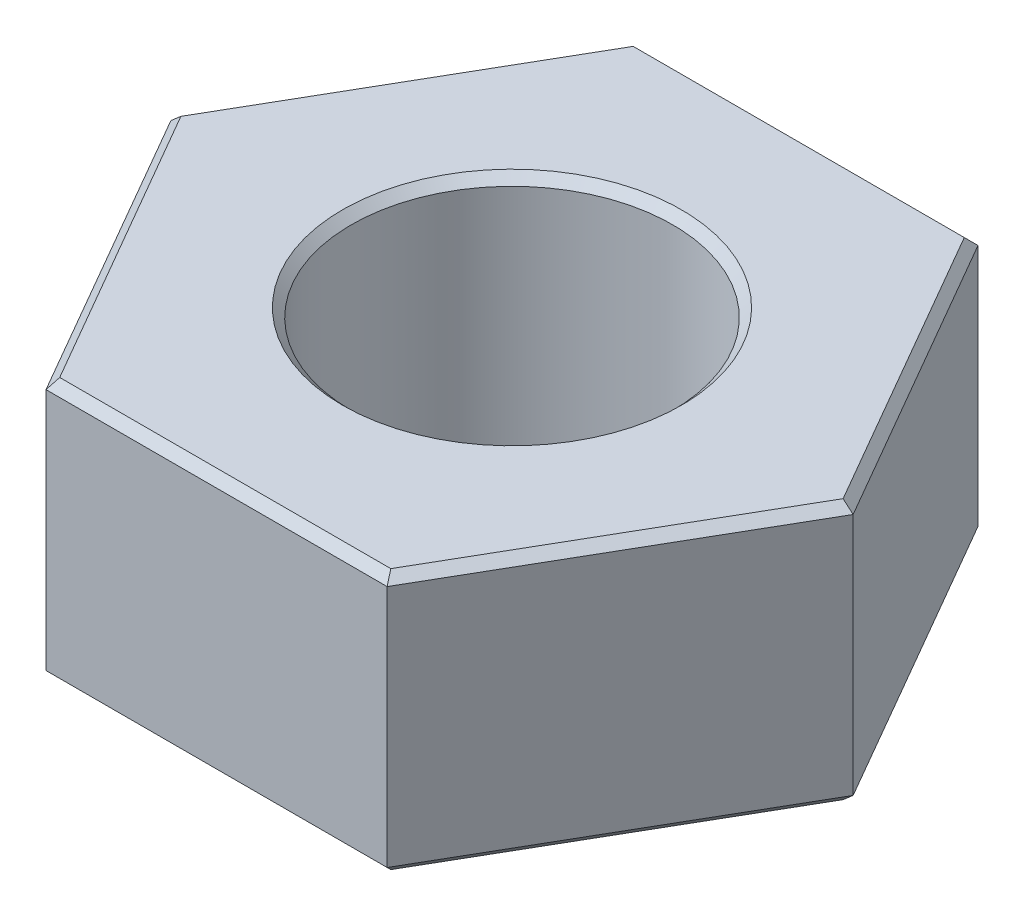
ISO-10303-21;
HEADER;
FILE_DESCRIPTION(('STEP AP214'),'2;1');
FILE_NAME('part.step','',(''),(''),'','','');
FILE_SCHEMA(('AUTOMOTIVE_DESIGN { 1 0 10303 214 1 1 1 1 }'));
ENDSEC;
DATA;
#1=APPLICATION_CONTEXT('core data for automotive mechanical design processes');
#2=APPLICATION_PROTOCOL_DEFINITION('international standard','automotive_design',2000,#1);
#3=PRODUCT_CONTEXT('',#1,'mechanical');
#4=PRODUCT('Part','Part','',(#3));
#5=PRODUCT_RELATED_PRODUCT_CATEGORY('part','',(#4));
#6=PRODUCT_DEFINITION_FORMATION('','',#4);
#7=PRODUCT_DEFINITION_CONTEXT('part definition',#1,'design');
#8=PRODUCT_DEFINITION('design','',#6,#7);
#9=PRODUCT_DEFINITION_SHAPE('','',#8);
#10=(LENGTH_UNIT() NAMED_UNIT(*) SI_UNIT(.MILLI.,.METRE.));
#11=(NAMED_UNIT(*) PLANE_ANGLE_UNIT() SI_UNIT($,.RADIAN.));
#12=(NAMED_UNIT(*) SI_UNIT($,.STERADIAN.) SOLID_ANGLE_UNIT());
#13=UNCERTAINTY_MEASURE_WITH_UNIT(LENGTH_MEASURE(1.E-05),#10,'distance_accuracy_value','');
#14=(GEOMETRIC_REPRESENTATION_CONTEXT(3) GLOBAL_UNCERTAINTY_ASSIGNED_CONTEXT((#13)) GLOBAL_UNIT_ASSIGNED_CONTEXT((#10,
#11,#12)) REPRESENTATION_CONTEXT('',''));
#15=CARTESIAN_POINT('',(0.,0.,0.));
#16=DIRECTION('',(0.,0.,1.));
#17=DIRECTION('',(1.,0.,0.));
#18=AXIS2_PLACEMENT_3D('',#15,#16,#17);
#19=CARTESIAN_POINT('',(0.,3.,0.));
#20=DIRECTION('',(0.,1.,0.));
#21=DIRECTION('',(0.,0.,1.));
#22=AXIS2_PLACEMENT_3D('',#19,#20,#21);
#23=PLANE('',#22);
#24=DIRECTION('',(-0.500000000000001,0.,-0.866025403784438));
#25=VECTOR('',#24,1.);
#26=CARTESIAN_POINT('',(1.87638837486628,3.,-3.35000000000001));
#27=LINE('',#26,#25);
#28=CARTESIAN_POINT('',(3.81051177665153,3.,0.));
#29=VERTEX_POINT('',#28);
#30=CARTESIAN_POINT('',(1.90525588832576,3.,-3.30000000000001));
#31=VERTEX_POINT('',#30);
#32=EDGE_CURVE('E59',#29,#31,#27,.T.);
#33=ORIENTED_EDGE('',*,*,#32,.T.);
#34=DIRECTION('',(-1.,0.,0.));
#35=VECTOR('',#34,1.);
#36=CARTESIAN_POINT('',(-1.96299091524474,3.,-3.29999999999999));
#37=LINE('',#36,#35);
#38=CARTESIAN_POINT('',(-1.90525588832578,3.,-3.29999999999999));
#39=VERTEX_POINT('',#38);
#40=EDGE_CURVE('E11',#31,#39,#37,.T.);
#41=ORIENTED_EDGE('',*,*,#40,.T.);
#42=DIRECTION('',(-0.499999999999995,0.,0.866025403784442));
#43=VECTOR('',#42,1.);
#44=CARTESIAN_POINT('',(-3.83937929011101,3.,0.0500000000000267));
#45=LINE('',#44,#43);
#46=CARTESIAN_POINT('',(-3.81051177665153,3.,0.));
#47=VERTEX_POINT('',#46);
#48=EDGE_CURVE('E44',#39,#47,#45,.T.);
#49=ORIENTED_EDGE('',*,*,#48,.T.);
#50=DIRECTION('',(0.500000000000007,0.,0.866025403784435));
#51=VECTOR('',#50,1.);
#52=CARTESIAN_POINT('',(-1.87638837486625,3.,3.35000000000002));
#53=LINE('',#52,#51);
#54=CARTESIAN_POINT('',(-1.90525588832574,3.,3.30000000000002));
#55=VERTEX_POINT('',#54);
#56=EDGE_CURVE('E262',#47,#55,#53,.T.);
#57=ORIENTED_EDGE('',*,*,#56,.T.);
#58=DIRECTION('',(1.,0.,0.));
#59=VECTOR('',#58,1.);
#60=CARTESIAN_POINT('',(1.96299091524477,3.,3.29999999999998));
#61=LINE('',#60,#59);
#62=CARTESIAN_POINT('',(1.90525588832581,3.,3.29999999999998));
#63=VERTEX_POINT('',#62);
#64=EDGE_CURVE('E260',#55,#63,#61,.T.);
#65=ORIENTED_EDGE('',*,*,#64,.T.);
#66=DIRECTION('',(0.499999999999995,0.,-0.866025403784442));
#67=VECTOR('',#66,1.);
#68=CARTESIAN_POINT('',(3.83937929011101,3.,-0.0499999999999993));
#69=LINE('',#68,#67);
#70=EDGE_CURVE('E264',#63,#29,#69,.T.);
#71=ORIENTED_EDGE('',*,*,#70,.T.);
#72=EDGE_LOOP('',(#33,#41,#49,#57,#65,#71));
#73=FACE_BOUND('',#72,.T.);
#74=CARTESIAN_POINT('',(0.,3.,0.));
#75=DIRECTION('',(0.,1.,0.));
#76=DIRECTION('',(0.,0.,1.));
#77=AXIS2_PLACEMENT_3D('',#74,#75,#76);
#78=CIRCLE('',#77,1.95);
#79=CARTESIAN_POINT('',(0.,3.,1.95));
#80=VERTEX_POINT('',#79);
#81=EDGE_CURVE('E257',#80,#80,#78,.F.);
#82=ORIENTED_EDGE('',*,*,#81,.T.);
#83=EDGE_LOOP('',(#82));
#84=FACE_BOUND('',#83,.T.);
#85=ADVANCED_FACE('F35',(#73,#84),#23,.T.);
#86=CARTESIAN_POINT('',(0.,0.,0.));
#87=DIRECTION('',(0.,1.,0.));
#88=DIRECTION('',(0.,0.,1.));
#89=AXIS2_PLACEMENT_3D('',#86,#87,#88);
#90=PLANE('',#89);
#91=DIRECTION('',(0.499999999999995,0.,-0.866025403784442));
#92=VECTOR('',#91,1.);
#93=CARTESIAN_POINT('',(-2.85788383248866,0.,-1.64999999999998));
#94=LINE('',#93,#92);
#95=CARTESIAN_POINT('',(-3.81051177665153,0.,0.));
#96=VERTEX_POINT('',#95);
#97=CARTESIAN_POINT('',(-1.90525588832578,0.,-3.29999999999999));
#98=VERTEX_POINT('',#97);
#99=EDGE_CURVE('E230',#96,#98,#94,.T.);
#100=ORIENTED_EDGE('',*,*,#99,.T.);
#101=DIRECTION('',(1.,0.,0.));
#102=VECTOR('',#101,1.);
#103=CARTESIAN_POINT('',(0.,0.,-3.3));
#104=LINE('',#103,#102);
#105=CARTESIAN_POINT('',(1.90525588832576,0.,-3.30000000000001));
#106=VERTEX_POINT('',#105);
#107=EDGE_CURVE('E139',#98,#106,#104,.T.);
#108=ORIENTED_EDGE('',*,*,#107,.T.);
#109=DIRECTION('',(0.500000000000001,0.,0.866025403784438));
#110=VECTOR('',#109,1.);
#111=CARTESIAN_POINT('',(2.85788383248865,0.,-1.65));
#112=LINE('',#111,#110);
#113=CARTESIAN_POINT('',(3.81051177665153,0.,0.));
#114=VERTEX_POINT('',#113);
#115=EDGE_CURVE('E222',#106,#114,#112,.T.);
#116=ORIENTED_EDGE('',*,*,#115,.T.);
#117=DIRECTION('',(-0.499999999999995,0.,0.866025403784442));
#118=VECTOR('',#117,1.);
#119=CARTESIAN_POINT('',(2.85788383248867,0.,1.64999999999999));
#120=LINE('',#119,#118);
#121=CARTESIAN_POINT('',(1.9052558883258,0.,3.29999999999998));
#122=VERTEX_POINT('',#121);
#123=EDGE_CURVE('E224',#114,#122,#120,.T.);
#124=ORIENTED_EDGE('',*,*,#123,.T.);
#125=DIRECTION('',(-1.,0.,0.));
#126=VECTOR('',#125,1.);
#127=CARTESIAN_POINT('',(0.,0.,3.3));
#128=LINE('',#127,#126);
#129=CARTESIAN_POINT('',(-1.90525588832574,0.,3.30000000000002));
#130=VERTEX_POINT('',#129);
#131=EDGE_CURVE('E226',#122,#130,#128,.T.);
#132=ORIENTED_EDGE('',*,*,#131,.T.);
#133=DIRECTION('',(-0.500000000000007,0.,-0.866025403784435));
#134=VECTOR('',#133,1.);
#135=CARTESIAN_POINT('',(-2.85788383248863,0.,1.65000000000002));
#136=LINE('',#135,#134);
#137=EDGE_CURVE('E228',#130,#96,#136,.T.);
#138=ORIENTED_EDGE('',*,*,#137,.T.);
#139=EDGE_LOOP('',(#100,#108,#116,#124,#132,#138));
#140=FACE_BOUND('',#139,.T.);
#141=CARTESIAN_POINT('',(0.,0.,0.));
#142=DIRECTION('',(0.,1.,0.));
#143=DIRECTION('',(0.,0.,1.));
#144=AXIS2_PLACEMENT_3D('',#141,#142,#143);
#145=CIRCLE('',#144,1.95);
#146=CARTESIAN_POINT('',(0.,0.,1.95));
#147=VERTEX_POINT('',#146);
#148=EDGE_CURVE('E219',#147,#147,#145,.T.);
#149=ORIENTED_EDGE('',*,*,#148,.T.);
#150=EDGE_LOOP('',(#149));
#151=FACE_BOUND('',#150,.T.);
#152=ADVANCED_FACE('F307',(#140,#151),#90,.F.);
#153=CARTESIAN_POINT('',(1.96299091524477,3.,3.39999999999998));
#154=DIRECTION('',(-0.866025403784441,0.,-0.499999999999995));
#155=DIRECTION('',(-0.499999999999995,0.,0.866025403784442));
#156=AXIS2_PLACEMENT_3D('',#153,#154,#155);
#157=PLANE('',#156);
#158=DIRECTION('',(0.,-1.,0.));
#159=VECTOR('',#158,1.);
#160=CARTESIAN_POINT('',(1.96299091524477,3.,3.39999999999998));
#161=LINE('',#160,#159);
#162=CARTESIAN_POINT('',(1.96299091524477,2.9,3.39999999999998));
#163=VERTEX_POINT('',#162);
#164=CARTESIAN_POINT('',(1.96299091524477,0.0999999999999998,3.39999999999998));
#165=VERTEX_POINT('',#164);
#166=EDGE_CURVE('E201',#163,#165,#161,.T.);
#167=ORIENTED_EDGE('',*,*,#166,.T.);
#168=DIRECTION('',(0.499999999999995,0.,-0.866025403784442));
#169=VECTOR('',#168,1.);
#170=CARTESIAN_POINT('',(1.96299091524477,0.0999999999999998,3.39999999999998));
#171=LINE('',#170,#169);
#172=CARTESIAN_POINT('',(3.92598183048946,0.100000000000001,0.));
#173=VERTEX_POINT('',#172);
#174=EDGE_CURVE('E245',#165,#173,#171,.T.);
#175=ORIENTED_EDGE('',*,*,#174,.T.);
#176=DIRECTION('',(0.,-1.,0.));
#177=VECTOR('',#176,1.);
#178=CARTESIAN_POINT('',(3.92598183048946,3.,0.));
#179=LINE('',#178,#177);
#180=CARTESIAN_POINT('',(3.92598183048946,2.9,0.));
#181=VERTEX_POINT('',#180);
#182=EDGE_CURVE('E155',#181,#173,#179,.T.);
#183=ORIENTED_EDGE('',*,*,#182,.F.);
#184=DIRECTION('',(-0.499999999999995,0.,0.866025403784442));
#185=VECTOR('',#184,1.);
#186=CARTESIAN_POINT('',(1.96299091524477,2.9,3.39999999999998));
#187=LINE('',#186,#185);
#188=EDGE_CURVE('E243',#181,#163,#187,.T.);
#189=ORIENTED_EDGE('',*,*,#188,.T.);
#190=EDGE_LOOP('',(#167,#175,#183,#189));
#191=FACE_BOUND('',#190,.T.);
#192=ADVANCED_FACE('F285',(#191),#157,.F.);
#193=CARTESIAN_POINT('',(3.92598183048946,3.,0.));
#194=DIRECTION('',(-0.866025403784438,0.,0.500000000000001));
#195=DIRECTION('',(0.500000000000001,0.,0.866025403784438));
#196=AXIS2_PLACEMENT_3D('',#193,#194,#195);
#197=PLANE('',#196);
#198=ORIENTED_EDGE('',*,*,#182,.T.);
#199=DIRECTION('',(-0.500000000000001,0.,-0.866025403784438));
#200=VECTOR('',#199,1.);
#201=CARTESIAN_POINT('',(3.92598183048946,0.100000000000001,0.));
#202=LINE('',#201,#200);
#203=CARTESIAN_POINT('',(1.96299091524472,0.100000000000001,-3.40000000000001));
#204=VERTEX_POINT('',#203);
#205=EDGE_CURVE('E249',#173,#204,#202,.T.);
#206=ORIENTED_EDGE('',*,*,#205,.T.);
#207=DIRECTION('',(0.,-1.,0.));
#208=VECTOR('',#207,1.);
#209=CARTESIAN_POINT('',(1.96299091524472,3.,-3.40000000000001));
#210=LINE('',#209,#208);
#211=CARTESIAN_POINT('',(1.96299091524472,2.9,-3.40000000000001));
#212=VERTEX_POINT('',#211);
#213=EDGE_CURVE('E150',#212,#204,#210,.T.);
#214=ORIENTED_EDGE('',*,*,#213,.F.);
#215=DIRECTION('',(0.500000000000001,0.,0.866025403784438));
#216=VECTOR('',#215,1.);
#217=CARTESIAN_POINT('',(3.92598183048946,2.9,0.));
#218=LINE('',#217,#216);
#219=EDGE_CURVE('E247',#212,#181,#218,.T.);
#220=ORIENTED_EDGE('',*,*,#219,.T.);
#221=EDGE_LOOP('',(#198,#206,#214,#220));
#222=FACE_BOUND('',#221,.T.);
#223=ADVANCED_FACE('F283',(#222),#197,.F.);
#224=CARTESIAN_POINT('',(1.96299091524472,3.,-3.40000000000001));
#225=DIRECTION('',(0.,0.,1.));
#226=DIRECTION('',(1.,0.,0.));
#227=AXIS2_PLACEMENT_3D('',#224,#225,#226);
#228=PLANE('',#227);
#229=ORIENTED_EDGE('',*,*,#213,.T.);
#230=DIRECTION('',(-1.,0.,0.));
#231=VECTOR('',#230,1.);
#232=CARTESIAN_POINT('',(1.96299091524472,0.1,-3.40000000000001));
#233=LINE('',#232,#231);
#234=CARTESIAN_POINT('',(-1.96299091524474,0.1,-3.39999999999999));
#235=VERTEX_POINT('',#234);
#236=EDGE_CURVE('E149',#204,#235,#233,.T.);
#237=ORIENTED_EDGE('',*,*,#236,.T.);
#238=DIRECTION('',(0.,-1.,0.));
#239=VECTOR('',#238,1.);
#240=CARTESIAN_POINT('',(-1.96299091524474,3.,-3.39999999999999));
#241=LINE('',#240,#239);
#242=CARTESIAN_POINT('',(-1.96299091524474,2.9,-3.39999999999999));
#243=VERTEX_POINT('',#242);
#244=EDGE_CURVE('E132',#243,#235,#241,.T.);
#245=ORIENTED_EDGE('',*,*,#244,.F.);
#246=DIRECTION('',(1.,0.,0.));
#247=VECTOR('',#246,1.);
#248=CARTESIAN_POINT('',(1.96299091524472,2.9,-3.40000000000001));
#249=LINE('',#248,#247);
#250=EDGE_CURVE('E146',#243,#212,#249,.T.);
#251=ORIENTED_EDGE('',*,*,#250,.T.);
#252=EDGE_LOOP('',(#229,#237,#245,#251));
#253=FACE_BOUND('',#252,.T.);
#254=ADVANCED_FACE('F145',(#253),#228,.F.);
#255=CARTESIAN_POINT('',(-1.96299091524474,3.,-3.39999999999999));
#256=DIRECTION('',(0.866025403784441,0.,0.499999999999995));
#257=DIRECTION('',(0.499999999999995,0.,-0.866025403784442));
#258=AXIS2_PLACEMENT_3D('',#255,#256,#257);
#259=PLANE('',#258);
#260=ORIENTED_EDGE('',*,*,#244,.T.);
#261=DIRECTION('',(-0.499999999999995,0.,0.866025403784442));
#262=VECTOR('',#261,1.);
#263=CARTESIAN_POINT('',(-1.96299091524474,0.1,-3.39999999999999));
#264=LINE('',#263,#262);
#265=CARTESIAN_POINT('',(-3.92598183048946,0.1,0.));
#266=VERTEX_POINT('',#265);
#267=EDGE_CURVE('E138',#235,#266,#264,.T.);
#268=ORIENTED_EDGE('',*,*,#267,.T.);
#269=DIRECTION('',(0.,-1.,0.));
#270=VECTOR('',#269,1.);
#271=CARTESIAN_POINT('',(-3.92598183048946,3.,0.));
#272=LINE('',#271,#270);
#273=CARTESIAN_POINT('',(-3.92598183048946,2.9,0.));
#274=VERTEX_POINT('',#273);
#275=EDGE_CURVE('E134',#274,#266,#272,.T.);
#276=ORIENTED_EDGE('',*,*,#275,.F.);
#277=DIRECTION('',(0.499999999999995,0.,-0.866025403784442));
#278=VECTOR('',#277,1.);
#279=CARTESIAN_POINT('',(-1.96299091524474,2.9,-3.39999999999999));
#280=LINE('',#279,#278);
#281=EDGE_CURVE('E129',#274,#243,#280,.T.);
#282=ORIENTED_EDGE('',*,*,#281,.T.);
#283=EDGE_LOOP('',(#260,#268,#276,#282));
#284=FACE_BOUND('',#283,.T.);
#285=ADVANCED_FACE('F131',(#284),#259,.F.);
#286=CARTESIAN_POINT('',(-3.92598183048946,3.,0.));
#287=DIRECTION('',(0.866025403784435,0.,-0.500000000000007));
#288=DIRECTION('',(-0.500000000000007,0.,-0.866025403784434));
#289=AXIS2_PLACEMENT_3D('',#286,#287,#288);
#290=PLANE('',#289);
#291=ORIENTED_EDGE('',*,*,#275,.T.);
#292=DIRECTION('',(0.500000000000007,0.,0.866025403784434));
#293=VECTOR('',#292,1.);
#294=CARTESIAN_POINT('',(-3.92598183048946,0.1,0.));
#295=LINE('',#294,#293);
#296=CARTESIAN_POINT('',(-1.9629909152447,0.1,3.40000000000002));
#297=VERTEX_POINT('',#296);
#298=EDGE_CURVE('E237',#266,#297,#295,.T.);
#299=ORIENTED_EDGE('',*,*,#298,.T.);
#300=DIRECTION('',(0.,-1.,0.));
#301=VECTOR('',#300,1.);
#302=CARTESIAN_POINT('',(-1.9629909152447,3.,3.40000000000002));
#303=LINE('',#302,#301);
#304=CARTESIAN_POINT('',(-1.9629909152447,2.9,3.40000000000002));
#305=VERTEX_POINT('',#304);
#306=EDGE_CURVE('E207',#305,#297,#303,.T.);
#307=ORIENTED_EDGE('',*,*,#306,.F.);
#308=DIRECTION('',(-0.500000000000007,0.,-0.866025403784434));
#309=VECTOR('',#308,1.);
#310=CARTESIAN_POINT('',(-3.92598183048946,2.9,0.));
#311=LINE('',#310,#309);
#312=EDGE_CURVE('E235',#305,#274,#311,.T.);
#313=ORIENTED_EDGE('',*,*,#312,.T.);
#314=EDGE_LOOP('',(#291,#299,#307,#313));
#315=FACE_BOUND('',#314,.T.);
#316=ADVANCED_FACE('F271',(#315),#290,.F.);
#317=CARTESIAN_POINT('',(-1.9629909152447,3.,3.40000000000002));
#318=DIRECTION('',(0.,0.,-1.));
#319=DIRECTION('',(-1.,0.,0.));
#320=AXIS2_PLACEMENT_3D('',#317,#318,#319);
#321=PLANE('',#320);
#322=ORIENTED_EDGE('',*,*,#306,.T.);
#323=DIRECTION('',(1.,0.,0.));
#324=VECTOR('',#323,1.);
#325=CARTESIAN_POINT('',(-1.9629909152447,0.1,3.40000000000002));
#326=LINE('',#325,#324);
#327=EDGE_CURVE('E241',#297,#165,#326,.T.);
#328=ORIENTED_EDGE('',*,*,#327,.T.);
#329=ORIENTED_EDGE('',*,*,#166,.F.);
#330=DIRECTION('',(-1.,0.,0.));
#331=VECTOR('',#330,1.);
#332=CARTESIAN_POINT('',(-1.9629909152447,2.9,3.40000000000002));
#333=LINE('',#332,#331);
#334=EDGE_CURVE('E239',#163,#305,#333,.T.);
#335=ORIENTED_EDGE('',*,*,#334,.T.);
#336=EDGE_LOOP('',(#322,#328,#329,#335));
#337=FACE_BOUND('',#336,.T.);
#338=ADVANCED_FACE('F317',(#337),#321,.F.);
#339=CARTESIAN_POINT('',(0.,3.,0.));
#340=DIRECTION('',(0.,-1.,0.));
#341=DIRECTION('',(0.,0.,-1.));
#342=AXIS2_PLACEMENT_3D('',#339,#340,#341);
#343=CYLINDRICAL_SURFACE('',#342,1.85);
#344=CARTESIAN_POINT('',(0.,0.099999999999999,0.));
#345=DIRECTION('',(0.,1.,0.));
#346=DIRECTION('',(0.,0.,1.));
#347=AXIS2_PLACEMENT_3D('',#344,#345,#346);
#348=CIRCLE('',#347,1.85);
#349=CARTESIAN_POINT('',(0.,0.099999999999999,1.85));
#350=VERTEX_POINT('',#349);
#351=EDGE_CURVE('E254',#350,#350,#348,.F.);
#352=ORIENTED_EDGE('',*,*,#351,.T.);
#353=EDGE_LOOP('',(#352));
#354=FACE_BOUND('',#353,.T.);
#355=CARTESIAN_POINT('',(0.,2.9,0.));
#356=DIRECTION('',(0.,1.,0.));
#357=DIRECTION('',(0.,0.,1.));
#358=AXIS2_PLACEMENT_3D('',#355,#356,#357);
#359=CIRCLE('',#358,1.85);
#360=CARTESIAN_POINT('',(0.,2.9,1.85));
#361=VERTEX_POINT('',#360);
#362=EDGE_CURVE('E251',#361,#361,#359,.T.);
#363=ORIENTED_EDGE('',*,*,#362,.T.);
#364=EDGE_LOOP('',(#363));
#365=FACE_BOUND('',#364,.T.);
#366=ADVANCED_FACE('F315',(#354,#365),#343,.F.);
#367=CARTESIAN_POINT('',(-1.9629909152447,0.1,3.40000000000002));
#368=DIRECTION('',(0.,0.707106781186544,-0.707106781186551));
#369=DIRECTION('',(1.,0.,0.));
#370=AXIS2_PLACEMENT_3D('',#367,#368,#369);
#371=PLANE('',#370);
#372=DIRECTION('',(0.377964473009221,-0.654653670707981,-0.654653670707977));
#373=VECTOR('',#372,1.);
#374=CARTESIAN_POINT('',(-1.9629909152447,0.1,3.40000000000002));
#375=LINE('',#374,#373);
#376=EDGE_CURVE('E194',#130,#297,#375,.F.);
#377=ORIENTED_EDGE('',*,*,#376,.F.);
#378=ORIENTED_EDGE('',*,*,#131,.F.);
#379=DIRECTION('',(-0.377964473009234,-0.654653670707981,-0.65465367070797));
#380=VECTOR('',#379,1.);
#381=CARTESIAN_POINT('',(1.96299091524477,0.1,3.39999999999998));
#382=LINE('',#381,#380);
#383=EDGE_CURVE('E162',#165,#122,#382,.T.);
#384=ORIENTED_EDGE('',*,*,#383,.F.);
#385=ORIENTED_EDGE('',*,*,#327,.F.);
#386=EDGE_LOOP('',(#377,#378,#384,#385));
#387=FACE_BOUND('',#386,.T.);
#388=ADVANCED_FACE('F358',(#387),#371,.F.);
#389=CARTESIAN_POINT('',(1.96299091524477,0.1,3.39999999999998));
#390=DIRECTION('',(-0.612372435695798,0.707106781186546,-0.353553390593271));
#391=DIRECTION('',(0.499999999999995,0.,-0.866025403784442));
#392=AXIS2_PLACEMENT_3D('',#389,#390,#391);
#393=PLANE('',#392);
#394=ORIENTED_EDGE('',*,*,#383,.T.);
#395=ORIENTED_EDGE('',*,*,#123,.F.);
#396=DIRECTION('',(-0.755928946018452,-0.65465367070798,0.));
#397=VECTOR('',#396,1.);
#398=CARTESIAN_POINT('',(3.92598183048946,0.1,0.));
#399=LINE('',#398,#397);
#400=EDGE_CURVE('E192',#173,#114,#399,.T.);
#401=ORIENTED_EDGE('',*,*,#400,.F.);
#402=ORIENTED_EDGE('',*,*,#174,.F.);
#403=EDGE_LOOP('',(#394,#395,#401,#402));
#404=FACE_BOUND('',#403,.T.);
#405=ADVANCED_FACE('F286',(#404),#393,.F.);
#406=CARTESIAN_POINT('',(-3.92598183048946,0.1,0.));
#407=DIRECTION('',(0.612372435695794,0.707106781186545,-0.35355339059328));
#408=DIRECTION('',(0.500000000000007,0.,0.866025403784434));
#409=AXIS2_PLACEMENT_3D('',#406,#407,#408);
#410=PLANE('',#409);
#411=ORIENTED_EDGE('',*,*,#376,.T.);
#412=ORIENTED_EDGE('',*,*,#298,.F.);
#413=DIRECTION('',(0.755928946018453,-0.654653670707979,0.));
#414=VECTOR('',#413,1.);
#415=CARTESIAN_POINT('',(-3.92598183048946,0.1,0.));
#416=LINE('',#415,#414);
#417=EDGE_CURVE('E186',#96,#266,#416,.F.);
#418=ORIENTED_EDGE('',*,*,#417,.F.);
#419=ORIENTED_EDGE('',*,*,#137,.F.);
#420=EDGE_LOOP('',(#411,#412,#418,#419));
#421=FACE_BOUND('',#420,.T.);
#422=ADVANCED_FACE('F372',(#421),#410,.F.);
#423=CARTESIAN_POINT('',(3.92598183048946,0.1,0.));
#424=DIRECTION('',(-0.612372435695796,0.707106781186545,0.353553390593276));
#425=DIRECTION('',(-0.500000000000001,0.,-0.866025403784438));
#426=AXIS2_PLACEMENT_3D('',#423,#424,#425);
#427=PLANE('',#426);
#428=ORIENTED_EDGE('',*,*,#400,.T.);
#429=ORIENTED_EDGE('',*,*,#115,.F.);
#430=DIRECTION('',(0.377964473009227,0.65465367070798,-0.654653670707974));
#431=VECTOR('',#430,1.);
#432=CARTESIAN_POINT('',(1.40213636803195,-0.871428571428571,-2.42857142857144));
#433=LINE('',#432,#431);
#434=EDGE_CURVE('E180',#204,#106,#433,.F.);
#435=ORIENTED_EDGE('',*,*,#434,.F.);
#436=ORIENTED_EDGE('',*,*,#205,.F.);
#437=EDGE_LOOP('',(#428,#429,#435,#436));
#438=FACE_BOUND('',#437,.T.);
#439=ADVANCED_FACE('F291',(#438),#427,.F.);
#440=CARTESIAN_POINT('',(-1.96299091524474,0.1,-3.39999999999999));
#441=DIRECTION('',(0.612372435695798,0.707106781186546,0.353553390593271));
#442=DIRECTION('',(-0.499999999999995,0.,0.866025403784442));
#443=AXIS2_PLACEMENT_3D('',#440,#441,#442);
#444=PLANE('',#443);
#445=ORIENTED_EDGE('',*,*,#417,.T.);
#446=ORIENTED_EDGE('',*,*,#267,.F.);
#447=DIRECTION('',(0.377964473009234,-0.65465367070798,0.654653670707971));
#448=VECTOR('',#447,1.);
#449=CARTESIAN_POINT('',(-1.96299091524474,0.1,-3.39999999999999));
#450=LINE('',#449,#448);
#451=EDGE_CURVE('E175',#98,#235,#450,.F.);
#452=ORIENTED_EDGE('',*,*,#451,.F.);
#453=ORIENTED_EDGE('',*,*,#99,.F.);
#454=EDGE_LOOP('',(#445,#446,#452,#453));
#455=FACE_BOUND('',#454,.T.);
#456=ADVANCED_FACE('F295',(#455),#444,.F.);
#457=CARTESIAN_POINT('',(1.96299091524472,0.1,-3.40000000000001));
#458=DIRECTION('',(0.,0.707106781186544,0.707106781186551));
#459=DIRECTION('',(-1.,0.,0.));
#460=AXIS2_PLACEMENT_3D('',#457,#458,#459);
#461=PLANE('',#460);
#462=ORIENTED_EDGE('',*,*,#434,.T.);
#463=ORIENTED_EDGE('',*,*,#107,.F.);
#464=ORIENTED_EDGE('',*,*,#451,.T.);
#465=ORIENTED_EDGE('',*,*,#236,.F.);
#466=EDGE_LOOP('',(#462,#463,#464,#465));
#467=FACE_BOUND('',#466,.T.);
#468=ADVANCED_FACE('F292',(#467),#461,.F.);
#469=CARTESIAN_POINT('',(0.,0.,0.));
#470=DIRECTION('',(0.,-1.,0.));
#471=DIRECTION('',(0.,0.,-1.));
#472=AXIS2_PLACEMENT_3D('',#469,#470,#471);
#473=CONICAL_SURFACE('',#472,1.95,0.785398163397446);
#474=ORIENTED_EDGE('',*,*,#351,.F.);
#475=EDGE_LOOP('',(#474));
#476=FACE_BOUND('',#475,.T.);
#477=ORIENTED_EDGE('',*,*,#148,.F.);
#478=EDGE_LOOP('',(#477));
#479=FACE_BOUND('',#478,.T.);
#480=ADVANCED_FACE('F294',(#476,#479),#473,.F.);
#481=CARTESIAN_POINT('',(0.,3.,3.3));
#482=DIRECTION('',(0.,0.707106781186544,0.707106781186551));
#483=DIRECTION('',(-1.,0.,0.));
#484=AXIS2_PLACEMENT_3D('',#481,#482,#483);
#485=PLANE('',#484);
#486=DIRECTION('',(-0.37796447300922,-0.654653670707981,0.654653670707978));
#487=VECTOR('',#486,1.);
#488=CARTESIAN_POINT('',(-1.63307647570777,3.47142857142858,2.82857142857145));
#489=LINE('',#488,#487);
#490=EDGE_CURVE('E168',#305,#55,#489,.F.);
#491=ORIENTED_EDGE('',*,*,#490,.F.);
#492=ORIENTED_EDGE('',*,*,#334,.F.);
#493=DIRECTION('',(-0.377964473009234,0.654653670707981,-0.65465367070797));
#494=VECTOR('',#493,1.);
#495=CARTESIAN_POINT('',(1.63307647570783,3.47142857142858,2.82857142857141));
#496=LINE('',#495,#494);
#497=EDGE_CURVE('E39',#63,#163,#496,.F.);
#498=ORIENTED_EDGE('',*,*,#497,.F.);
#499=ORIENTED_EDGE('',*,*,#64,.F.);
#500=EDGE_LOOP('',(#491,#492,#498,#499));
#501=FACE_BOUND('',#500,.T.);
#502=ADVANCED_FACE('F276',(#501),#485,.T.);
#503=CARTESIAN_POINT('',(2.85788383248867,3.,1.64999999999999));
#504=DIRECTION('',(0.612372435695798,0.707106781186546,0.353553390593271));
#505=DIRECTION('',(-0.499999999999995,0.,0.866025403784442));
#506=AXIS2_PLACEMENT_3D('',#503,#504,#505);
#507=PLANE('',#506);
#508=ORIENTED_EDGE('',*,*,#497,.T.);
#509=ORIENTED_EDGE('',*,*,#188,.F.);
#510=DIRECTION('',(-0.755928946018451,0.654653670707982,0.));
#511=VECTOR('',#510,1.);
#512=CARTESIAN_POINT('',(3.26615295141562,3.47142857142856,0.));
#513=LINE('',#512,#511);
#514=EDGE_CURVE('E166',#29,#181,#513,.F.);
#515=ORIENTED_EDGE('',*,*,#514,.F.);
#516=ORIENTED_EDGE('',*,*,#70,.F.);
#517=EDGE_LOOP('',(#508,#509,#515,#516));
#518=FACE_BOUND('',#517,.T.);
#519=ADVANCED_FACE('F278',(#518),#507,.T.);
#520=CARTESIAN_POINT('',(-2.85788383248863,3.,1.65000000000002));
#521=DIRECTION('',(-0.612372435695795,0.707106781186544,0.35355339059328));
#522=DIRECTION('',(-0.500000000000007,0.,-0.866025403784434));
#523=AXIS2_PLACEMENT_3D('',#520,#521,#522);
#524=PLANE('',#523);
#525=ORIENTED_EDGE('',*,*,#490,.T.);
#526=ORIENTED_EDGE('',*,*,#56,.F.);
#527=DIRECTION('',(-0.755928946018452,-0.65465367070798,0.));
#528=VECTOR('',#527,1.);
#529=CARTESIAN_POINT('',(-3.2661529514156,3.47142857142858,0.));
#530=LINE('',#529,#528);
#531=EDGE_CURVE('E159',#274,#47,#530,.F.);
#532=ORIENTED_EDGE('',*,*,#531,.F.);
#533=ORIENTED_EDGE('',*,*,#312,.F.);
#534=EDGE_LOOP('',(#525,#526,#532,#533));
#535=FACE_BOUND('',#534,.T.);
#536=ADVANCED_FACE('F268',(#535),#524,.T.);
#537=CARTESIAN_POINT('',(2.85788383248865,3.,-1.65));
#538=DIRECTION('',(0.612372435695799,0.707106781186542,-0.353553390593277));
#539=DIRECTION('',(0.500000000000001,0.,0.866025403784438));
#540=AXIS2_PLACEMENT_3D('',#537,#538,#539);
#541=PLANE('',#540);
#542=ORIENTED_EDGE('',*,*,#514,.T.);
#543=ORIENTED_EDGE('',*,*,#219,.F.);
#544=DIRECTION('',(-0.377964473009221,0.654653670707982,0.654653670707976));
#545=VECTOR('',#544,1.);
#546=CARTESIAN_POINT('',(1.6330764757078,3.47142857142858,-2.82857142857143));
#547=LINE('',#546,#545);
#548=EDGE_CURVE('E153',#31,#212,#547,.F.);
#549=ORIENTED_EDGE('',*,*,#548,.F.);
#550=ORIENTED_EDGE('',*,*,#32,.F.);
#551=EDGE_LOOP('',(#542,#543,#549,#550));
#552=FACE_BOUND('',#551,.T.);
#553=ADVANCED_FACE('F280',(#552),#541,.T.);
#554=CARTESIAN_POINT('',(-2.85788383248866,3.,-1.64999999999998));
#555=DIRECTION('',(-0.612372435695799,0.707106781186545,-0.353553390593272));
#556=DIRECTION('',(0.499999999999995,0.,-0.866025403784442));
#557=AXIS2_PLACEMENT_3D('',#554,#555,#556);
#558=PLANE('',#557);
#559=ORIENTED_EDGE('',*,*,#531,.T.);
#560=ORIENTED_EDGE('',*,*,#48,.F.);
#561=DIRECTION('',(-0.377964473009231,-0.65465367070798,-0.654653670707972));
#562=VECTOR('',#561,1.);
#563=CARTESIAN_POINT('',(-1.63307647570781,3.47142857142857,-2.82857142857143));
#564=LINE('',#563,#562);
#565=EDGE_CURVE('E52',#243,#39,#564,.F.);
#566=ORIENTED_EDGE('',*,*,#565,.F.);
#567=ORIENTED_EDGE('',*,*,#281,.F.);
#568=EDGE_LOOP('',(#559,#560,#566,#567));
#569=FACE_BOUND('',#568,.T.);
#570=ADVANCED_FACE('F157',(#569),#558,.T.);
#571=CARTESIAN_POINT('',(0.,3.,-3.3));
#572=DIRECTION('',(0.,0.707106781186544,-0.707106781186551));
#573=DIRECTION('',(1.,0.,0.));
#574=AXIS2_PLACEMENT_3D('',#571,#572,#573);
#575=PLANE('',#574);
#576=ORIENTED_EDGE('',*,*,#548,.T.);
#577=ORIENTED_EDGE('',*,*,#250,.F.);
#578=ORIENTED_EDGE('',*,*,#565,.T.);
#579=ORIENTED_EDGE('',*,*,#40,.F.);
#580=EDGE_LOOP('',(#576,#577,#578,#579));
#581=FACE_BOUND('',#580,.T.);
#582=ADVANCED_FACE('F152',(#581),#575,.T.);
#583=CARTESIAN_POINT('',(0.,2.9,0.));
#584=DIRECTION('',(0.,1.,0.));
#585=DIRECTION('',(0.,0.,1.));
#586=AXIS2_PLACEMENT_3D('',#583,#584,#585);
#587=CONICAL_SURFACE('',#586,1.85,0.785398163397447);
#588=ORIENTED_EDGE('',*,*,#81,.F.);
#589=EDGE_LOOP('',(#588));
#590=FACE_BOUND('',#589,.T.);
#591=ORIENTED_EDGE('',*,*,#362,.F.);
#592=EDGE_LOOP('',(#591));
#593=FACE_BOUND('',#592,.T.);
#594=ADVANCED_FACE('F37',(#590,#593),#587,.F.);
#595=CLOSED_SHELL('',(#85,#152,#192,#223,#254,#285,#316,#338,#366,#388,#405,#422,#439,#456,#468,
#480,#502,#519,#536,#553,#570,#582,#594));
#596=MANIFOLD_SOLID_BREP('B2',#595);
#597=ADVANCED_BREP_SHAPE_REPRESENTATION('',(#18,#596),#14);
#598=SHAPE_DEFINITION_REPRESENTATION(#9,#597);
ENDSEC;
END-ISO-10303-21;
